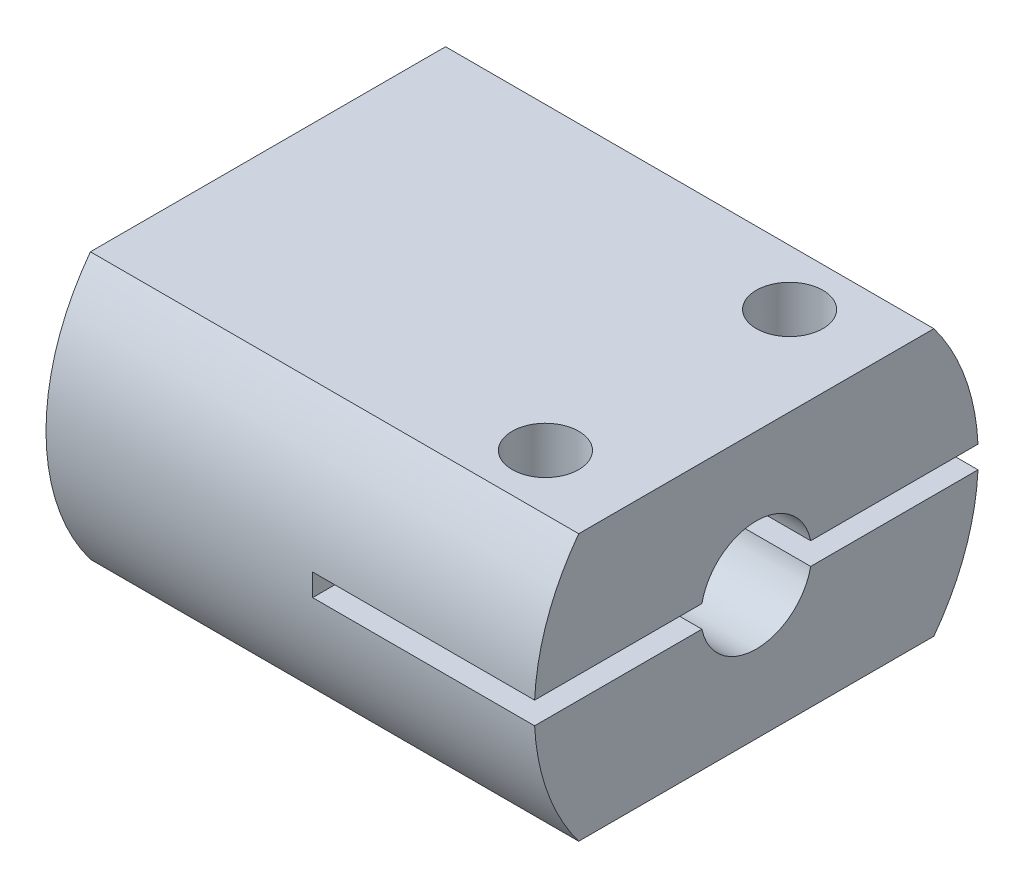
ISO-10303-21;
HEADER;
FILE_DESCRIPTION(('STEP AP214'),'2;1');
FILE_NAME('part.step','',(''),(''),'','','');
FILE_SCHEMA(('AUTOMOTIVE_DESIGN { 1 0 10303 214 1 1 1 1 }'));
ENDSEC;
DATA;
#1=APPLICATION_CONTEXT('core data for automotive mechanical design processes');
#2=APPLICATION_PROTOCOL_DEFINITION('international standard','automotive_design',2000,#1);
#3=PRODUCT_CONTEXT('',#1,'mechanical');
#4=PRODUCT('Part','Part','',(#3));
#5=PRODUCT_RELATED_PRODUCT_CATEGORY('part','',(#4));
#6=PRODUCT_DEFINITION_FORMATION('','',#4);
#7=PRODUCT_DEFINITION_CONTEXT('part definition',#1,'design');
#8=PRODUCT_DEFINITION('design','',#6,#7);
#9=PRODUCT_DEFINITION_SHAPE('','',#8);
#10=(LENGTH_UNIT() NAMED_UNIT(*) SI_UNIT(.MILLI.,.METRE.));
#11=(NAMED_UNIT(*) PLANE_ANGLE_UNIT() SI_UNIT($,.RADIAN.));
#12=(NAMED_UNIT(*) SI_UNIT($,.STERADIAN.) SOLID_ANGLE_UNIT());
#13=UNCERTAINTY_MEASURE_WITH_UNIT(LENGTH_MEASURE(1.E-05),#10,'distance_accuracy_value','');
#14=(GEOMETRIC_REPRESENTATION_CONTEXT(3) GLOBAL_UNCERTAINTY_ASSIGNED_CONTEXT((#13)) GLOBAL_UNIT_ASSIGNED_CONTEXT((#10,
#11,#12)) REPRESENTATION_CONTEXT('',''));
#15=CARTESIAN_POINT('',(0.,0.,0.));
#16=DIRECTION('',(0.,0.,1.));
#17=DIRECTION('',(1.,0.,0.));
#18=AXIS2_PLACEMENT_3D('',#15,#16,#17);
#19=CARTESIAN_POINT('',(22.,0.,0.));
#20=DIRECTION('',(-1.,0.,0.));
#21=DIRECTION('',(0.,0.,1.));
#22=AXIS2_PLACEMENT_3D('',#19,#20,#21);
#23=CYLINDRICAL_SURFACE('',#22,10.);
#24=CARTESIAN_POINT('',(22.,0.,0.));
#25=DIRECTION('',(1.,0.,0.));
#26=DIRECTION('',(0.,0.,-1.));
#27=AXIS2_PLACEMENT_3D('',#24,#25,#26);
#28=CIRCLE('',#27,10.);
#29=CARTESIAN_POINT('',(22.,-6.,-8.));
#30=VERTEX_POINT('',#29);
#31=CARTESIAN_POINT('',(22.,-0.5,-9.98749217771909));
#32=VERTEX_POINT('',#31);
#33=EDGE_CURVE('E42',#30,#32,#28,.T.);
#34=ORIENTED_EDGE('',*,*,#33,.F.);
#35=DIRECTION('',(1.,0.,0.));
#36=VECTOR('',#35,1.);
#37=CARTESIAN_POINT('',(0.,-6.,-8.));
#38=LINE('',#37,#36);
#39=CARTESIAN_POINT('',(0.,-6.,-8.));
#40=VERTEX_POINT('',#39);
#41=EDGE_CURVE('E149',#40,#30,#38,.T.);
#42=ORIENTED_EDGE('',*,*,#41,.F.);
#43=CARTESIAN_POINT('',(0.,0.,0.));
#44=DIRECTION('',(1.,0.,0.));
#45=DIRECTION('',(0.,0.,-1.));
#46=AXIS2_PLACEMENT_3D('',#43,#44,#45);
#47=CIRCLE('',#46,10.);
#48=CARTESIAN_POINT('',(0.,6.,-8.));
#49=VERTEX_POINT('',#48);
#50=EDGE_CURVE('E58',#40,#49,#47,.T.);
#51=ORIENTED_EDGE('',*,*,#50,.T.);
#52=DIRECTION('',(1.,0.,0.));
#53=VECTOR('',#52,1.);
#54=CARTESIAN_POINT('',(0.,6.,-8.));
#55=LINE('',#54,#53);
#56=CARTESIAN_POINT('',(22.,6.,-8.));
#57=VERTEX_POINT('',#56);
#58=EDGE_CURVE('E222',#49,#57,#55,.T.);
#59=ORIENTED_EDGE('',*,*,#58,.T.);
#60=CARTESIAN_POINT('',(22.,0.5,-9.98749217771909));
#61=VERTEX_POINT('',#60);
#62=EDGE_CURVE('E11',#61,#57,#28,.T.);
#63=ORIENTED_EDGE('',*,*,#62,.F.);
#64=DIRECTION('',(1.,0.,0.));
#65=VECTOR('',#64,1.);
#66=CARTESIAN_POINT('',(12.,0.5,-9.98749217771909));
#67=LINE('',#66,#65);
#68=CARTESIAN_POINT('',(12.,0.5,-9.98749217771909));
#69=VERTEX_POINT('',#68);
#70=EDGE_CURVE('E193',#69,#61,#67,.T.);
#71=ORIENTED_EDGE('',*,*,#70,.F.);
#72=CARTESIAN_POINT('',(12.,0.,0.));
#73=DIRECTION('',(1.,0.,0.));
#74=DIRECTION('',(0.,0.,-1.));
#75=AXIS2_PLACEMENT_3D('',#72,#73,#74);
#76=CIRCLE('',#75,10.);
#77=CARTESIAN_POINT('',(12.,-0.5,-9.98749217771909));
#78=VERTEX_POINT('',#77);
#79=EDGE_CURVE('E236',#78,#69,#76,.T.);
#80=ORIENTED_EDGE('',*,*,#79,.F.);
#81=DIRECTION('',(1.,0.,0.));
#82=VECTOR('',#81,1.);
#83=CARTESIAN_POINT('',(12.,-0.5,-9.98749217771909));
#84=LINE('',#83,#82);
#85=EDGE_CURVE('E191',#78,#32,#84,.T.);
#86=ORIENTED_EDGE('',*,*,#85,.T.);
#87=EDGE_LOOP('',(#34,#42,#51,#59,#63,#71,#80,#86));
#88=FACE_BOUND('',#87,.T.);
#89=ADVANCED_FACE('F32',(#88),#23,.T.);
#90=CARTESIAN_POINT('',(12.,0.,0.));
#91=DIRECTION('',(-1.,0.,0.));
#92=DIRECTION('',(0.,0.,1.));
#93=AXIS2_PLACEMENT_3D('',#90,#91,#92);
#94=PLANE('',#93);
#95=DIRECTION('',(0.,0.,-1.));
#96=VECTOR('',#95,1.);
#97=CARTESIAN_POINT('',(12.,0.5,0.));
#98=LINE('',#97,#96);
#99=CARTESIAN_POINT('',(12.,0.5,3.96862696659689));
#100=VERTEX_POINT('',#99);
#101=CARTESIAN_POINT('',(12.,0.5,2.44948974278318));
#102=VERTEX_POINT('',#101);
#103=EDGE_CURVE('E228',#100,#102,#98,.T.);
#104=ORIENTED_EDGE('',*,*,#103,.F.);
#105=CARTESIAN_POINT('',(12.,0.,0.));
#106=DIRECTION('',(-1.,0.,0.));
#107=DIRECTION('',(0.,0.,1.));
#108=AXIS2_PLACEMENT_3D('',#105,#106,#107);
#109=CIRCLE('',#108,4.);
#110=CARTESIAN_POINT('',(12.,3.46410161513775,2.));
#111=VERTEX_POINT('',#110);
#112=EDGE_CURVE('E174',#100,#111,#109,.T.);
#113=ORIENTED_EDGE('',*,*,#112,.T.);
#114=DIRECTION('',(0.,0.,-1.));
#115=VECTOR('',#114,1.);
#116=CARTESIAN_POINT('',(12.,3.46410161513775,-2.));
#117=LINE('',#116,#115);
#118=CARTESIAN_POINT('',(12.,3.46410161513775,-2.));
#119=VERTEX_POINT('',#118);
#120=EDGE_CURVE('E169',#111,#119,#117,.T.);
#121=ORIENTED_EDGE('',*,*,#120,.T.);
#122=CARTESIAN_POINT('',(12.,0.5,-3.96862696659689));
#123=VERTEX_POINT('',#122);
#124=EDGE_CURVE('E180',#119,#123,#109,.T.);
#125=ORIENTED_EDGE('',*,*,#124,.T.);
#126=DIRECTION('',(0.,0.,-1.));
#127=VECTOR('',#126,1.);
#128=CARTESIAN_POINT('',(12.,0.5,0.));
#129=LINE('',#128,#127);
#130=CARTESIAN_POINT('',(12.,0.5,-2.44948974278318));
#131=VERTEX_POINT('',#130);
#132=EDGE_CURVE('E232',#131,#123,#129,.T.);
#133=ORIENTED_EDGE('',*,*,#132,.F.);
#134=CARTESIAN_POINT('',(12.,0.,0.));
#135=DIRECTION('',(1.,0.,0.));
#136=DIRECTION('',(0.,0.,-1.));
#137=AXIS2_PLACEMENT_3D('',#134,#135,#136);
#138=CIRCLE('',#137,2.5);
#139=EDGE_CURVE('E229',#131,#102,#138,.T.);
#140=ORIENTED_EDGE('',*,*,#139,.T.);
#141=EDGE_LOOP('',(#104,#113,#121,#125,#133,#140));
#142=FACE_BOUND('',#141,.T.);
#143=ADVANCED_FACE('F336',(#142),#94,.T.);
#144=CARTESIAN_POINT('',(0.,6.,8.));
#145=VERTEX_POINT('',#144);
#146=CARTESIAN_POINT('',(0.,-6.,8.));
#147=VERTEX_POINT('',#146);
#148=EDGE_CURVE('E36',#145,#147,#47,.T.);
#149=ORIENTED_EDGE('',*,*,#148,.T.);
#150=DIRECTION('',(1.,0.,0.));
#151=VECTOR('',#150,1.);
#152=CARTESIAN_POINT('',(0.,-6.,8.));
#153=LINE('',#152,#151);
#154=CARTESIAN_POINT('',(22.,-6.,8.));
#155=VERTEX_POINT('',#154);
#156=EDGE_CURVE('E50',#147,#155,#153,.T.);
#157=ORIENTED_EDGE('',*,*,#156,.T.);
#158=CARTESIAN_POINT('',(22.,-0.5,9.98749217771909));
#159=VERTEX_POINT('',#158);
#160=EDGE_CURVE('E43',#159,#155,#28,.T.);
#161=ORIENTED_EDGE('',*,*,#160,.F.);
#162=DIRECTION('',(1.,0.,0.));
#163=VECTOR('',#162,1.);
#164=CARTESIAN_POINT('',(12.,-0.5,9.98749217771909));
#165=LINE('',#164,#163);
#166=CARTESIAN_POINT('',(12.,-0.5,9.98749217771909));
#167=VERTEX_POINT('',#166);
#168=EDGE_CURVE('E202',#167,#159,#165,.T.);
#169=ORIENTED_EDGE('',*,*,#168,.F.);
#170=CARTESIAN_POINT('',(12.,0.,0.));
#171=DIRECTION('',(1.,0.,0.));
#172=DIRECTION('',(0.,0.,-1.));
#173=AXIS2_PLACEMENT_3D('',#170,#171,#172);
#174=CIRCLE('',#173,10.);
#175=CARTESIAN_POINT('',(12.,0.5,9.98749217771909));
#176=VERTEX_POINT('',#175);
#177=EDGE_CURVE('E189',#176,#167,#174,.T.);
#178=ORIENTED_EDGE('',*,*,#177,.F.);
#179=DIRECTION('',(1.,0.,0.));
#180=VECTOR('',#179,1.);
#181=CARTESIAN_POINT('',(12.,0.5,9.98749217771909));
#182=LINE('',#181,#180);
#183=CARTESIAN_POINT('',(22.,0.5,9.98749217771909));
#184=VERTEX_POINT('',#183);
#185=EDGE_CURVE('E199',#176,#184,#182,.T.);
#186=ORIENTED_EDGE('',*,*,#185,.T.);
#187=CARTESIAN_POINT('',(22.,6.,8.));
#188=VERTEX_POINT('',#187);
#189=EDGE_CURVE('E41',#188,#184,#28,.T.);
#190=ORIENTED_EDGE('',*,*,#189,.F.);
#191=DIRECTION('',(1.,0.,0.));
#192=VECTOR('',#191,1.);
#193=CARTESIAN_POINT('',(0.,6.,8.));
#194=LINE('',#193,#192);
#195=EDGE_CURVE('E249',#145,#188,#194,.T.);
#196=ORIENTED_EDGE('',*,*,#195,.F.);
#197=EDGE_LOOP('',(#149,#157,#161,#169,#178,#186,#190,#196));
#198=FACE_BOUND('',#197,.T.);
#199=ADVANCED_FACE('F34',(#198),#23,.T.);
#200=CARTESIAN_POINT('',(22.,0.,0.));
#201=DIRECTION('',(1.,0.,0.));
#202=DIRECTION('',(0.,0.,-1.));
#203=AXIS2_PLACEMENT_3D('',#200,#201,#202);
#204=PLANE('',#203);
#205=DIRECTION('',(0.,0.,-1.));
#206=VECTOR('',#205,1.);
#207=CARTESIAN_POINT('',(22.,6.,8.));
#208=LINE('',#207,#206);
#209=EDGE_CURVE('E252',#188,#57,#208,.T.);
#210=ORIENTED_EDGE('',*,*,#209,.F.);
#211=ORIENTED_EDGE('',*,*,#189,.T.);
#212=DIRECTION('',(0.,0.,-1.));
#213=VECTOR('',#212,1.);
#214=CARTESIAN_POINT('',(22.,0.5,0.));
#215=LINE('',#214,#213);
#216=CARTESIAN_POINT('',(22.,0.5,2.44948974278318));
#217=VERTEX_POINT('',#216);
#218=EDGE_CURVE('E204',#184,#217,#215,.T.);
#219=ORIENTED_EDGE('',*,*,#218,.T.);
#220=CARTESIAN_POINT('',(22.,0.,0.));
#221=DIRECTION('',(1.,0.,0.));
#222=DIRECTION('',(0.,0.,-1.));
#223=AXIS2_PLACEMENT_3D('',#220,#221,#222);
#224=CIRCLE('',#223,2.5);
#225=CARTESIAN_POINT('',(22.,0.5,-2.44948974278318));
#226=VERTEX_POINT('',#225);
#227=EDGE_CURVE('E208',#226,#217,#224,.T.);
#228=ORIENTED_EDGE('',*,*,#227,.F.);
#229=DIRECTION('',(0.,0.,-1.));
#230=VECTOR('',#229,1.);
#231=CARTESIAN_POINT('',(22.,0.5,0.));
#232=LINE('',#231,#230);
#233=EDGE_CURVE('E211',#226,#61,#232,.T.);
#234=ORIENTED_EDGE('',*,*,#233,.T.);
#235=ORIENTED_EDGE('',*,*,#62,.T.);
#236=EDGE_LOOP('',(#210,#211,#219,#228,#234,#235));
#237=FACE_BOUND('',#236,.T.);
#238=ADVANCED_FACE('F356',(#237),#204,.T.);
#239=DIRECTION('',(0.,0.,1.));
#240=VECTOR('',#239,1.);
#241=CARTESIAN_POINT('',(22.,-6.,-8.));
#242=LINE('',#241,#240);
#243=EDGE_CURVE('E154',#30,#155,#242,.T.);
#244=ORIENTED_EDGE('',*,*,#243,.F.);
#245=ORIENTED_EDGE('',*,*,#33,.T.);
#246=DIRECTION('',(0.,0.,-1.));
#247=VECTOR('',#246,1.);
#248=CARTESIAN_POINT('',(22.,-0.5,0.));
#249=LINE('',#248,#247);
#250=CARTESIAN_POINT('',(22.,-0.5,-2.44948974278318));
#251=VERTEX_POINT('',#250);
#252=EDGE_CURVE('E214',#251,#32,#249,.T.);
#253=ORIENTED_EDGE('',*,*,#252,.F.);
#254=CARTESIAN_POINT('',(22.,0.,0.));
#255=DIRECTION('',(1.,0.,0.));
#256=DIRECTION('',(0.,0.,-1.));
#257=AXIS2_PLACEMENT_3D('',#254,#255,#256);
#258=CIRCLE('',#257,2.5);
#259=CARTESIAN_POINT('',(22.,-0.5,2.44948974278318));
#260=VERTEX_POINT('',#259);
#261=EDGE_CURVE('E217',#260,#251,#258,.T.);
#262=ORIENTED_EDGE('',*,*,#261,.F.);
#263=DIRECTION('',(0.,0.,-1.));
#264=VECTOR('',#263,1.);
#265=CARTESIAN_POINT('',(22.,-0.5,0.));
#266=LINE('',#265,#264);
#267=EDGE_CURVE('E220',#159,#260,#266,.T.);
#268=ORIENTED_EDGE('',*,*,#267,.F.);
#269=ORIENTED_EDGE('',*,*,#160,.T.);
#270=EDGE_LOOP('',(#244,#245,#253,#262,#268,#269));
#271=FACE_BOUND('',#270,.T.);
#272=ADVANCED_FACE('F310',(#271),#204,.T.);
#273=CARTESIAN_POINT('',(0.,0.,0.));
#274=DIRECTION('',(1.,0.,0.));
#275=DIRECTION('',(0.,0.,-1.));
#276=AXIS2_PLACEMENT_3D('',#273,#274,#275);
#277=PLANE('',#276);
#278=DIRECTION('',(0.,0.,-1.));
#279=VECTOR('',#278,1.);
#280=CARTESIAN_POINT('',(0.,3.46410161513775,-2.));
#281=LINE('',#280,#279);
#282=CARTESIAN_POINT('',(0.,3.46410161513775,2.));
#283=VERTEX_POINT('',#282);
#284=CARTESIAN_POINT('',(0.,3.46410161513775,-2.));
#285=VERTEX_POINT('',#284);
#286=EDGE_CURVE('E172',#283,#285,#281,.T.);
#287=ORIENTED_EDGE('',*,*,#286,.F.);
#288=CARTESIAN_POINT('',(0.,0.,0.));
#289=DIRECTION('',(-1.,0.,0.));
#290=DIRECTION('',(0.,0.,1.));
#291=AXIS2_PLACEMENT_3D('',#288,#289,#290);
#292=CIRCLE('',#291,4.);
#293=EDGE_CURVE('E175',#285,#283,#292,.T.);
#294=ORIENTED_EDGE('',*,*,#293,.F.);
#295=EDGE_LOOP('',(#287,#294));
#296=FACE_BOUND('',#295,.T.);
#297=ORIENTED_EDGE('',*,*,#50,.F.);
#298=DIRECTION('',(0.,0.,1.));
#299=VECTOR('',#298,1.);
#300=CARTESIAN_POINT('',(0.,-6.,-8.));
#301=LINE('',#300,#299);
#302=EDGE_CURVE('E147',#40,#147,#301,.T.);
#303=ORIENTED_EDGE('',*,*,#302,.T.);
#304=ORIENTED_EDGE('',*,*,#148,.F.);
#305=DIRECTION('',(0.,0.,-1.));
#306=VECTOR('',#305,1.);
#307=CARTESIAN_POINT('',(0.,6.,8.));
#308=LINE('',#307,#306);
#309=EDGE_CURVE('E161',#145,#49,#308,.T.);
#310=ORIENTED_EDGE('',*,*,#309,.T.);
#311=EDGE_LOOP('',(#297,#303,#304,#310));
#312=FACE_BOUND('',#311,.T.);
#313=ADVANCED_FACE('F160',(#296,#312),#277,.F.);
#314=CARTESIAN_POINT('',(12.,0.,0.));
#315=DIRECTION('',(-1.,0.,0.));
#316=DIRECTION('',(0.,0.,1.));
#317=AXIS2_PLACEMENT_3D('',#314,#315,#316);
#318=CYLINDRICAL_SURFACE('',#317,4.);
#319=ORIENTED_EDGE('',*,*,#293,.T.);
#320=DIRECTION('',(-1.,0.,0.));
#321=VECTOR('',#320,1.);
#322=CARTESIAN_POINT('',(12.,3.46410161513775,2.));
#323=LINE('',#322,#321);
#324=EDGE_CURVE('E163',#111,#283,#323,.T.);
#325=ORIENTED_EDGE('',*,*,#324,.F.);
#326=ORIENTED_EDGE('',*,*,#112,.F.);
#327=CARTESIAN_POINT('',(12.,-0.5,3.96862696659689));
#328=VERTEX_POINT('',#327);
#329=EDGE_CURVE('E184',#328,#100,#109,.T.);
#330=ORIENTED_EDGE('',*,*,#329,.F.);
#331=CARTESIAN_POINT('',(12.,-0.5,-3.96862696659689));
#332=VERTEX_POINT('',#331);
#333=EDGE_CURVE('E183',#332,#328,#109,.T.);
#334=ORIENTED_EDGE('',*,*,#333,.F.);
#335=EDGE_CURVE('E177',#123,#332,#109,.T.);
#336=ORIENTED_EDGE('',*,*,#335,.F.);
#337=ORIENTED_EDGE('',*,*,#124,.F.);
#338=DIRECTION('',(-1.,0.,0.));
#339=VECTOR('',#338,1.);
#340=CARTESIAN_POINT('',(12.,3.46410161513775,-2.));
#341=LINE('',#340,#339);
#342=EDGE_CURVE('E162',#119,#285,#341,.T.);
#343=ORIENTED_EDGE('',*,*,#342,.T.);
#344=EDGE_LOOP('',(#319,#325,#326,#330,#334,#336,#337,#343));
#345=FACE_BOUND('',#344,.T.);
#346=ADVANCED_FACE('F326',(#345),#318,.F.);
#347=CARTESIAN_POINT('',(12.,3.46410161513775,-2.));
#348=DIRECTION('',(0.,1.,0.));
#349=DIRECTION('',(0.,0.,1.));
#350=AXIS2_PLACEMENT_3D('',#347,#348,#349);
#351=PLANE('',#350);
#352=ORIENTED_EDGE('',*,*,#286,.T.);
#353=ORIENTED_EDGE('',*,*,#342,.F.);
#354=ORIENTED_EDGE('',*,*,#120,.F.);
#355=ORIENTED_EDGE('',*,*,#324,.T.);
#356=EDGE_LOOP('',(#352,#353,#354,#355));
#357=FACE_BOUND('',#356,.T.);
#358=ADVANCED_FACE('F344',(#357),#351,.F.);
#359=ORIENTED_EDGE('',*,*,#333,.T.);
#360=DIRECTION('',(0.,0.,-1.));
#361=VECTOR('',#360,1.);
#362=CARTESIAN_POINT('',(12.,-0.5,0.));
#363=LINE('',#362,#361);
#364=CARTESIAN_POINT('',(12.,-0.5,2.44948974278318));
#365=VERTEX_POINT('',#364);
#366=EDGE_CURVE('E207',#328,#365,#363,.T.);
#367=ORIENTED_EDGE('',*,*,#366,.T.);
#368=CARTESIAN_POINT('',(12.,0.,0.));
#369=DIRECTION('',(1.,0.,0.));
#370=DIRECTION('',(0.,0.,-1.));
#371=AXIS2_PLACEMENT_3D('',#368,#369,#370);
#372=CIRCLE('',#371,2.5);
#373=CARTESIAN_POINT('',(12.,-0.5,-2.44948974278318));
#374=VERTEX_POINT('',#373);
#375=EDGE_CURVE('E243',#365,#374,#372,.T.);
#376=ORIENTED_EDGE('',*,*,#375,.T.);
#377=DIRECTION('',(0.,0.,-1.));
#378=VECTOR('',#377,1.);
#379=CARTESIAN_POINT('',(12.,-0.5,0.));
#380=LINE('',#379,#378);
#381=EDGE_CURVE('E239',#374,#332,#380,.T.);
#382=ORIENTED_EDGE('',*,*,#381,.T.);
#383=EDGE_LOOP('',(#359,#367,#376,#382));
#384=FACE_BOUND('',#383,.T.);
#385=ADVANCED_FACE('F324',(#384),#94,.T.);
#386=CARTESIAN_POINT('',(12.,0.,0.));
#387=DIRECTION('',(1.,0.,0.));
#388=DIRECTION('',(0.,0.,-1.));
#389=AXIS2_PLACEMENT_3D('',#386,#387,#388);
#390=PLANE('',#389);
#391=ORIENTED_EDGE('',*,*,#335,.T.);
#392=EDGE_CURVE('E242',#332,#78,#380,.T.);
#393=ORIENTED_EDGE('',*,*,#392,.T.);
#394=ORIENTED_EDGE('',*,*,#79,.T.);
#395=EDGE_CURVE('E235',#123,#69,#129,.T.);
#396=ORIENTED_EDGE('',*,*,#395,.F.);
#397=EDGE_LOOP('',(#391,#393,#394,#396));
#398=FACE_BOUND('',#397,.T.);
#399=ADVANCED_FACE('F319',(#398),#390,.T.);
#400=ORIENTED_EDGE('',*,*,#329,.T.);
#401=EDGE_CURVE('E225',#176,#100,#98,.T.);
#402=ORIENTED_EDGE('',*,*,#401,.F.);
#403=ORIENTED_EDGE('',*,*,#177,.T.);
#404=EDGE_CURVE('E246',#167,#328,#363,.T.);
#405=ORIENTED_EDGE('',*,*,#404,.T.);
#406=EDGE_LOOP('',(#400,#402,#403,#405));
#407=FACE_BOUND('',#406,.T.);
#408=ADVANCED_FACE('F296',(#407),#390,.T.);
#409=CARTESIAN_POINT('',(12.,-0.5,0.));
#410=DIRECTION('',(0.,-1.,0.));
#411=DIRECTION('',(0.,0.,-1.));
#412=AXIS2_PLACEMENT_3D('',#409,#410,#411);
#413=PLANE('',#412);
#414=CARTESIAN_POINT('',(18.,-0.5,5.5));
#415=DIRECTION('',(0.,-1.,0.));
#416=DIRECTION('',(0.,0.,-1.));
#417=AXIS2_PLACEMENT_3D('',#414,#415,#416);
#418=CIRCLE('',#417,1.5);
#419=CARTESIAN_POINT('',(18.,-0.5,4.));
#420=VERTEX_POINT('',#419);
#421=EDGE_CURVE('E267',#420,#420,#418,.T.);
#422=ORIENTED_EDGE('',*,*,#421,.T.);
#423=EDGE_LOOP('',(#422));
#424=FACE_BOUND('',#423,.T.);
#425=ORIENTED_EDGE('',*,*,#267,.T.);
#426=DIRECTION('',(1.,0.,0.));
#427=VECTOR('',#426,1.);
#428=CARTESIAN_POINT('',(12.,-0.5,2.44948974278318));
#429=LINE('',#428,#427);
#430=EDGE_CURVE('E185',#365,#260,#429,.T.);
#431=ORIENTED_EDGE('',*,*,#430,.F.);
#432=ORIENTED_EDGE('',*,*,#366,.F.);
#433=ORIENTED_EDGE('',*,*,#404,.F.);
#434=ORIENTED_EDGE('',*,*,#168,.T.);
#435=EDGE_LOOP('',(#425,#431,#432,#433,#434));
#436=FACE_BOUND('',#435,.T.);
#437=ADVANCED_FACE('F292',(#424,#436),#413,.F.);
#438=CARTESIAN_POINT('',(12.,0.5,0.));
#439=DIRECTION('',(0.,-1.,0.));
#440=DIRECTION('',(0.,0.,-1.));
#441=AXIS2_PLACEMENT_3D('',#438,#439,#440);
#442=PLANE('',#441);
#443=CARTESIAN_POINT('',(18.,0.5,5.5));
#444=DIRECTION('',(0.,-1.,0.));
#445=DIRECTION('',(0.,0.,-1.));
#446=AXIS2_PLACEMENT_3D('',#443,#444,#445);
#447=CIRCLE('',#446,1.5);
#448=CARTESIAN_POINT('',(18.,0.5,4.));
#449=VERTEX_POINT('',#448);
#450=EDGE_CURVE('E272',#449,#449,#447,.T.);
#451=ORIENTED_EDGE('',*,*,#450,.F.);
#452=EDGE_LOOP('',(#451));
#453=FACE_BOUND('',#452,.T.);
#454=ORIENTED_EDGE('',*,*,#218,.F.);
#455=ORIENTED_EDGE('',*,*,#185,.F.);
#456=ORIENTED_EDGE('',*,*,#401,.T.);
#457=ORIENTED_EDGE('',*,*,#103,.T.);
#458=DIRECTION('',(1.,0.,0.));
#459=VECTOR('',#458,1.);
#460=CARTESIAN_POINT('',(12.,0.5,2.44948974278318));
#461=LINE('',#460,#459);
#462=EDGE_CURVE('E197',#102,#217,#461,.T.);
#463=ORIENTED_EDGE('',*,*,#462,.T.);
#464=EDGE_LOOP('',(#454,#455,#456,#457,#463));
#465=FACE_BOUND('',#464,.T.);
#466=ADVANCED_FACE('F295',(#453,#465),#442,.T.);
#467=CARTESIAN_POINT('',(12.,0.,0.));
#468=DIRECTION('',(1.,0.,0.));
#469=DIRECTION('',(0.,0.,-1.));
#470=AXIS2_PLACEMENT_3D('',#467,#468,#469);
#471=CYLINDRICAL_SURFACE('',#470,2.5);
#472=ORIENTED_EDGE('',*,*,#227,.T.);
#473=ORIENTED_EDGE('',*,*,#462,.F.);
#474=ORIENTED_EDGE('',*,*,#139,.F.);
#475=DIRECTION('',(1.,0.,0.));
#476=VECTOR('',#475,1.);
#477=CARTESIAN_POINT('',(12.,0.5,-2.44948974278318));
#478=LINE('',#477,#476);
#479=EDGE_CURVE('E195',#131,#226,#478,.T.);
#480=ORIENTED_EDGE('',*,*,#479,.T.);
#481=EDGE_LOOP('',(#472,#473,#474,#480));
#482=FACE_BOUND('',#481,.T.);
#483=ADVANCED_FACE('F350',(#482),#471,.F.);
#484=CARTESIAN_POINT('',(12.,0.5,0.));
#485=DIRECTION('',(0.,-1.,0.));
#486=DIRECTION('',(0.,0.,-1.));
#487=AXIS2_PLACEMENT_3D('',#484,#485,#486);
#488=PLANE('',#487);
#489=CARTESIAN_POINT('',(18.,0.5,-5.5));
#490=DIRECTION('',(0.,-1.,0.));
#491=DIRECTION('',(0.,0.,-1.));
#492=AXIS2_PLACEMENT_3D('',#489,#490,#491);
#493=CIRCLE('',#492,1.5);
#494=CARTESIAN_POINT('',(18.,0.5,-7.));
#495=VERTEX_POINT('',#494);
#496=EDGE_CURVE('E256',#495,#495,#493,.T.);
#497=ORIENTED_EDGE('',*,*,#496,.F.);
#498=EDGE_LOOP('',(#497));
#499=FACE_BOUND('',#498,.T.);
#500=ORIENTED_EDGE('',*,*,#233,.F.);
#501=ORIENTED_EDGE('',*,*,#479,.F.);
#502=ORIENTED_EDGE('',*,*,#132,.T.);
#503=ORIENTED_EDGE('',*,*,#395,.T.);
#504=ORIENTED_EDGE('',*,*,#70,.T.);
#505=EDGE_LOOP('',(#500,#501,#502,#503,#504));
#506=FACE_BOUND('',#505,.T.);
#507=ADVANCED_FACE('F347',(#499,#506),#488,.T.);
#508=CARTESIAN_POINT('',(12.,-0.5,0.));
#509=DIRECTION('',(0.,-1.,0.));
#510=DIRECTION('',(0.,0.,-1.));
#511=AXIS2_PLACEMENT_3D('',#508,#509,#510);
#512=PLANE('',#511);
#513=CARTESIAN_POINT('',(18.,-0.5,-5.5));
#514=DIRECTION('',(0.,-1.,0.));
#515=DIRECTION('',(0.,0.,-1.));
#516=AXIS2_PLACEMENT_3D('',#513,#514,#515);
#517=CIRCLE('',#516,1.5);
#518=CARTESIAN_POINT('',(18.,-0.5,-7.));
#519=VERTEX_POINT('',#518);
#520=EDGE_CURVE('E260',#519,#519,#517,.T.);
#521=ORIENTED_EDGE('',*,*,#520,.T.);
#522=EDGE_LOOP('',(#521));
#523=FACE_BOUND('',#522,.T.);
#524=ORIENTED_EDGE('',*,*,#252,.T.);
#525=ORIENTED_EDGE('',*,*,#85,.F.);
#526=ORIENTED_EDGE('',*,*,#392,.F.);
#527=ORIENTED_EDGE('',*,*,#381,.F.);
#528=DIRECTION('',(1.,0.,0.));
#529=VECTOR('',#528,1.);
#530=CARTESIAN_POINT('',(12.,-0.5,-2.44948974278318));
#531=LINE('',#530,#529);
#532=EDGE_CURVE('E188',#374,#251,#531,.T.);
#533=ORIENTED_EDGE('',*,*,#532,.T.);
#534=EDGE_LOOP('',(#524,#525,#526,#527,#533));
#535=FACE_BOUND('',#534,.T.);
#536=ADVANCED_FACE('F313',(#523,#535),#512,.F.);
#537=CARTESIAN_POINT('',(12.,0.,0.));
#538=DIRECTION('',(1.,0.,0.));
#539=DIRECTION('',(0.,0.,-1.));
#540=AXIS2_PLACEMENT_3D('',#537,#538,#539);
#541=CYLINDRICAL_SURFACE('',#540,2.5);
#542=ORIENTED_EDGE('',*,*,#261,.T.);
#543=ORIENTED_EDGE('',*,*,#532,.F.);
#544=ORIENTED_EDGE('',*,*,#375,.F.);
#545=ORIENTED_EDGE('',*,*,#430,.T.);
#546=EDGE_LOOP('',(#542,#543,#544,#545));
#547=FACE_BOUND('',#546,.T.);
#548=ADVANCED_FACE('F306',(#547),#541,.F.);
#549=CARTESIAN_POINT('',(0.,6.,8.));
#550=DIRECTION('',(0.,-1.,0.));
#551=DIRECTION('',(0.,0.,-1.));
#552=AXIS2_PLACEMENT_3D('',#549,#550,#551);
#553=PLANE('',#552);
#554=CARTESIAN_POINT('',(18.,6.,5.5));
#555=DIRECTION('',(0.,1.,0.));
#556=DIRECTION('',(0.,0.,1.));
#557=AXIS2_PLACEMENT_3D('',#554,#555,#556);
#558=CIRCLE('',#557,1.5);
#559=CARTESIAN_POINT('',(18.,6.,7.));
#560=VERTEX_POINT('',#559);
#561=EDGE_CURVE('E276',#560,#560,#558,.T.);
#562=ORIENTED_EDGE('',*,*,#561,.F.);
#563=EDGE_LOOP('',(#562));
#564=FACE_BOUND('',#563,.T.);
#565=CARTESIAN_POINT('',(18.,6.,-5.5));
#566=DIRECTION('',(0.,1.,0.));
#567=DIRECTION('',(0.,0.,1.));
#568=AXIS2_PLACEMENT_3D('',#565,#566,#567);
#569=CIRCLE('',#568,1.5);
#570=CARTESIAN_POINT('',(18.,6.,-4.));
#571=VERTEX_POINT('',#570);
#572=EDGE_CURVE('E264',#571,#571,#569,.T.);
#573=ORIENTED_EDGE('',*,*,#572,.F.);
#574=EDGE_LOOP('',(#573));
#575=FACE_BOUND('',#574,.T.);
#576=ORIENTED_EDGE('',*,*,#209,.T.);
#577=ORIENTED_EDGE('',*,*,#58,.F.);
#578=ORIENTED_EDGE('',*,*,#309,.F.);
#579=ORIENTED_EDGE('',*,*,#195,.T.);
#580=EDGE_LOOP('',(#576,#577,#578,#579));
#581=FACE_BOUND('',#580,.T.);
#582=ADVANCED_FACE('F358',(#564,#575,#581),#553,.F.);
#583=CARTESIAN_POINT('',(0.,-6.,-8.));
#584=DIRECTION('',(0.,1.,0.));
#585=DIRECTION('',(0.,0.,1.));
#586=AXIS2_PLACEMENT_3D('',#583,#584,#585);
#587=PLANE('',#586);
#588=CARTESIAN_POINT('',(18.,-6.,5.5));
#589=DIRECTION('',(0.,1.,0.));
#590=DIRECTION('',(0.,0.,1.));
#591=AXIS2_PLACEMENT_3D('',#588,#589,#590);
#592=CIRCLE('',#591,1.5);
#593=CARTESIAN_POINT('',(18.,-6.,7.));
#594=VERTEX_POINT('',#593);
#595=EDGE_CURVE('E275',#594,#594,#592,.T.);
#596=ORIENTED_EDGE('',*,*,#595,.T.);
#597=EDGE_LOOP('',(#596));
#598=FACE_BOUND('',#597,.T.);
#599=CARTESIAN_POINT('',(18.,-6.,-5.5));
#600=DIRECTION('',(0.,1.,0.));
#601=DIRECTION('',(0.,0.,1.));
#602=AXIS2_PLACEMENT_3D('',#599,#600,#601);
#603=CIRCLE('',#602,1.5);
#604=CARTESIAN_POINT('',(18.,-6.,-4.));
#605=VERTEX_POINT('',#604);
#606=EDGE_CURVE('E263',#605,#605,#603,.T.);
#607=ORIENTED_EDGE('',*,*,#606,.T.);
#608=EDGE_LOOP('',(#607));
#609=FACE_BOUND('',#608,.T.);
#610=ORIENTED_EDGE('',*,*,#243,.T.);
#611=ORIENTED_EDGE('',*,*,#156,.F.);
#612=ORIENTED_EDGE('',*,*,#302,.F.);
#613=ORIENTED_EDGE('',*,*,#41,.T.);
#614=EDGE_LOOP('',(#610,#611,#612,#613));
#615=FACE_BOUND('',#614,.T.);
#616=ADVANCED_FACE('F148',(#598,#609,#615),#587,.F.);
#617=CARTESIAN_POINT('',(18.,-6.,-5.5));
#618=DIRECTION('',(0.,1.,0.));
#619=DIRECTION('',(0.,0.,1.));
#620=AXIS2_PLACEMENT_3D('',#617,#618,#619);
#621=CYLINDRICAL_SURFACE('',#620,1.5);
#622=ORIENTED_EDGE('',*,*,#606,.F.);
#623=EDGE_LOOP('',(#622));
#624=FACE_BOUND('',#623,.T.);
#625=ORIENTED_EDGE('',*,*,#520,.F.);
#626=EDGE_LOOP('',(#625));
#627=FACE_BOUND('',#626,.T.);
#628=ADVANCED_FACE('F366',(#624,#627),#621,.F.);
#629=ORIENTED_EDGE('',*,*,#496,.T.);
#630=EDGE_LOOP('',(#629));
#631=FACE_BOUND('',#630,.T.);
#632=ORIENTED_EDGE('',*,*,#572,.T.);
#633=EDGE_LOOP('',(#632));
#634=FACE_BOUND('',#633,.T.);
#635=ADVANCED_FACE('F288',(#631,#634),#621,.F.);
#636=CARTESIAN_POINT('',(18.,-6.,5.5));
#637=DIRECTION('',(0.,1.,0.));
#638=DIRECTION('',(0.,0.,1.));
#639=AXIS2_PLACEMENT_3D('',#636,#637,#638);
#640=CYLINDRICAL_SURFACE('',#639,1.5);
#641=ORIENTED_EDGE('',*,*,#595,.F.);
#642=EDGE_LOOP('',(#641));
#643=FACE_BOUND('',#642,.T.);
#644=ORIENTED_EDGE('',*,*,#421,.F.);
#645=EDGE_LOOP('',(#644));
#646=FACE_BOUND('',#645,.T.);
#647=ADVANCED_FACE('F284',(#643,#646),#640,.F.);
#648=ORIENTED_EDGE('',*,*,#450,.T.);
#649=EDGE_LOOP('',(#648));
#650=FACE_BOUND('',#649,.T.);
#651=ORIENTED_EDGE('',*,*,#561,.T.);
#652=EDGE_LOOP('',(#651));
#653=FACE_BOUND('',#652,.T.);
#654=ADVANCED_FACE('F287',(#650,#653),#640,.F.);
#655=CLOSED_SHELL('',(#89,#143,#199,#238,#272,#313,#346,#358,#385,#399,#408,#437,#466,#483,#507,
#536,#548,#582,#616,#628,#635,#647,#654));
#656=MANIFOLD_SOLID_BREP('B2',#655);
#657=ADVANCED_BREP_SHAPE_REPRESENTATION('',(#18,#656),#14);
#658=SHAPE_DEFINITION_REPRESENTATION(#9,#657);
ENDSEC;
END-ISO-10303-21;
